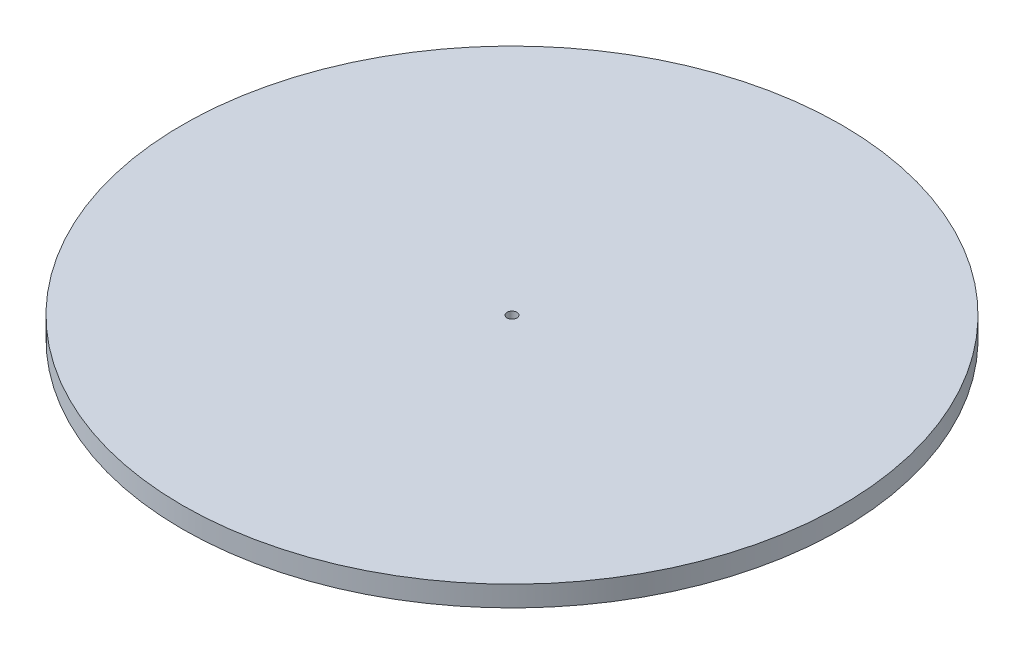
ISO-10303-21;
HEADER;
FILE_DESCRIPTION(('STEP AP214'),'2;1');
FILE_NAME('part.step','',(''),(''),'','','');
FILE_SCHEMA(('AUTOMOTIVE_DESIGN { 1 0 10303 214 1 1 1 1 }'));
ENDSEC;
DATA;
#1=APPLICATION_CONTEXT('core data for automotive mechanical design processes');
#2=APPLICATION_PROTOCOL_DEFINITION('international standard','automotive_design',2000,#1);
#3=PRODUCT_CONTEXT('',#1,'mechanical');
#4=PRODUCT('Part','Part','',(#3));
#5=PRODUCT_RELATED_PRODUCT_CATEGORY('part','',(#4));
#6=PRODUCT_DEFINITION_FORMATION('','',#4);
#7=PRODUCT_DEFINITION_CONTEXT('part definition',#1,'design');
#8=PRODUCT_DEFINITION('design','',#6,#7);
#9=PRODUCT_DEFINITION_SHAPE('','',#8);
#10=(LENGTH_UNIT() NAMED_UNIT(*) SI_UNIT(.MILLI.,.METRE.));
#11=(NAMED_UNIT(*) PLANE_ANGLE_UNIT() SI_UNIT($,.RADIAN.));
#12=(NAMED_UNIT(*) SI_UNIT($,.STERADIAN.) SOLID_ANGLE_UNIT());
#13=UNCERTAINTY_MEASURE_WITH_UNIT(LENGTH_MEASURE(1.E-05),#10,'distance_accuracy_value','');
#14=(GEOMETRIC_REPRESENTATION_CONTEXT(3) GLOBAL_UNCERTAINTY_ASSIGNED_CONTEXT((#13)) GLOBAL_UNIT_ASSIGNED_CONTEXT((#10,
#11,#12)) REPRESENTATION_CONTEXT('',''));
#15=CARTESIAN_POINT('',(0.,0.,0.));
#16=DIRECTION('',(0.,0.,1.));
#17=DIRECTION('',(1.,0.,0.));
#18=AXIS2_PLACEMENT_3D('',#15,#16,#17);
#19=CARTESIAN_POINT('',(0.,-3.175,0.));
#20=DIRECTION('',(0.,1.,0.));
#21=DIRECTION('',(0.,0.,1.));
#22=AXIS2_PLACEMENT_3D('',#19,#20,#21);
#23=CYLINDRICAL_SURFACE('',#22,50.8);
#24=CARTESIAN_POINT('',(0.,-3.175,0.));
#25=DIRECTION('',(0.,1.,0.));
#26=DIRECTION('',(0.,0.,1.));
#27=AXIS2_PLACEMENT_3D('',#24,#25,#26);
#28=CIRCLE('',#27,50.8);
#29=CARTESIAN_POINT('',(0.,-3.175,50.8));
#30=VERTEX_POINT('',#29);
#31=EDGE_CURVE('E10',#30,#30,#28,.T.);
#32=ORIENTED_EDGE('',*,*,#31,.T.);
#33=EDGE_LOOP('',(#32));
#34=FACE_BOUND('',#33,.T.);
#35=CARTESIAN_POINT('',(0.,0.,0.));
#36=DIRECTION('',(0.,1.,0.));
#37=DIRECTION('',(0.,0.,1.));
#38=AXIS2_PLACEMENT_3D('',#35,#36,#37);
#39=CIRCLE('',#38,50.8);
#40=CARTESIAN_POINT('',(0.,0.,50.8));
#41=VERTEX_POINT('',#40);
#42=EDGE_CURVE('E33',#41,#41,#39,.T.);
#43=ORIENTED_EDGE('',*,*,#42,.F.);
#44=EDGE_LOOP('',(#43));
#45=FACE_BOUND('',#44,.T.);
#46=ADVANCED_FACE('F30',(#34,#45),#23,.T.);
#47=CARTESIAN_POINT('',(0.,-3.175,0.));
#48=DIRECTION('',(0.,1.,0.));
#49=DIRECTION('',(0.,0.,1.));
#50=AXIS2_PLACEMENT_3D('',#47,#48,#49);
#51=PLANE('',#50);
#52=CARTESIAN_POINT('',(0.,-3.175,0.));
#53=DIRECTION('',(0.,1.,0.));
#54=DIRECTION('',(0.,0.,1.));
#55=AXIS2_PLACEMENT_3D('',#52,#53,#54);
#56=CIRCLE('',#55,0.762);
#57=CARTESIAN_POINT('',(0.,-3.175,0.762));
#58=VERTEX_POINT('',#57);
#59=EDGE_CURVE('E40',#58,#58,#56,.T.);
#60=ORIENTED_EDGE('',*,*,#59,.T.);
#61=EDGE_LOOP('',(#60));
#62=FACE_BOUND('',#61,.T.);
#63=ORIENTED_EDGE('',*,*,#31,.F.);
#64=EDGE_LOOP('',(#63));
#65=FACE_BOUND('',#64,.T.);
#66=ADVANCED_FACE('F48',(#62,#65),#51,.F.);
#67=CARTESIAN_POINT('',(0.,0.,0.));
#68=DIRECTION('',(0.,1.,0.));
#69=DIRECTION('',(0.,0.,1.));
#70=AXIS2_PLACEMENT_3D('',#67,#68,#69);
#71=PLANE('',#70);
#72=CARTESIAN_POINT('',(0.,0.,0.));
#73=DIRECTION('',(0.,1.,0.));
#74=DIRECTION('',(0.,0.,1.));
#75=AXIS2_PLACEMENT_3D('',#72,#73,#74);
#76=CIRCLE('',#75,0.762);
#77=CARTESIAN_POINT('',(0.,0.,0.762));
#78=VERTEX_POINT('',#77);
#79=EDGE_CURVE('E42',#78,#78,#76,.T.);
#80=ORIENTED_EDGE('',*,*,#79,.F.);
#81=EDGE_LOOP('',(#80));
#82=FACE_BOUND('',#81,.T.);
#83=ORIENTED_EDGE('',*,*,#42,.T.);
#84=EDGE_LOOP('',(#83));
#85=FACE_BOUND('',#84,.T.);
#86=ADVANCED_FACE('F54',(#82,#85),#71,.T.);
#87=CARTESIAN_POINT('',(0.,-3.175,0.));
#88=DIRECTION('',(0.,1.,0.));
#89=DIRECTION('',(0.,0.,1.));
#90=AXIS2_PLACEMENT_3D('',#87,#88,#89);
#91=CYLINDRICAL_SURFACE('',#90,0.762);
#92=ORIENTED_EDGE('',*,*,#59,.F.);
#93=EDGE_LOOP('',(#92));
#94=FACE_BOUND('',#93,.T.);
#95=ORIENTED_EDGE('',*,*,#79,.T.);
#96=EDGE_LOOP('',(#95));
#97=FACE_BOUND('',#96,.T.);
#98=ADVANCED_FACE('F51',(#94,#97),#91,.F.);
#99=CLOSED_SHELL('',(#46,#66,#86,#98));
#100=MANIFOLD_SOLID_BREP('B2',#99);
#101=ADVANCED_BREP_SHAPE_REPRESENTATION('',(#18,#100),#14);
#102=SHAPE_DEFINITION_REPRESENTATION(#9,#101);
ENDSEC;
END-ISO-10303-21;
